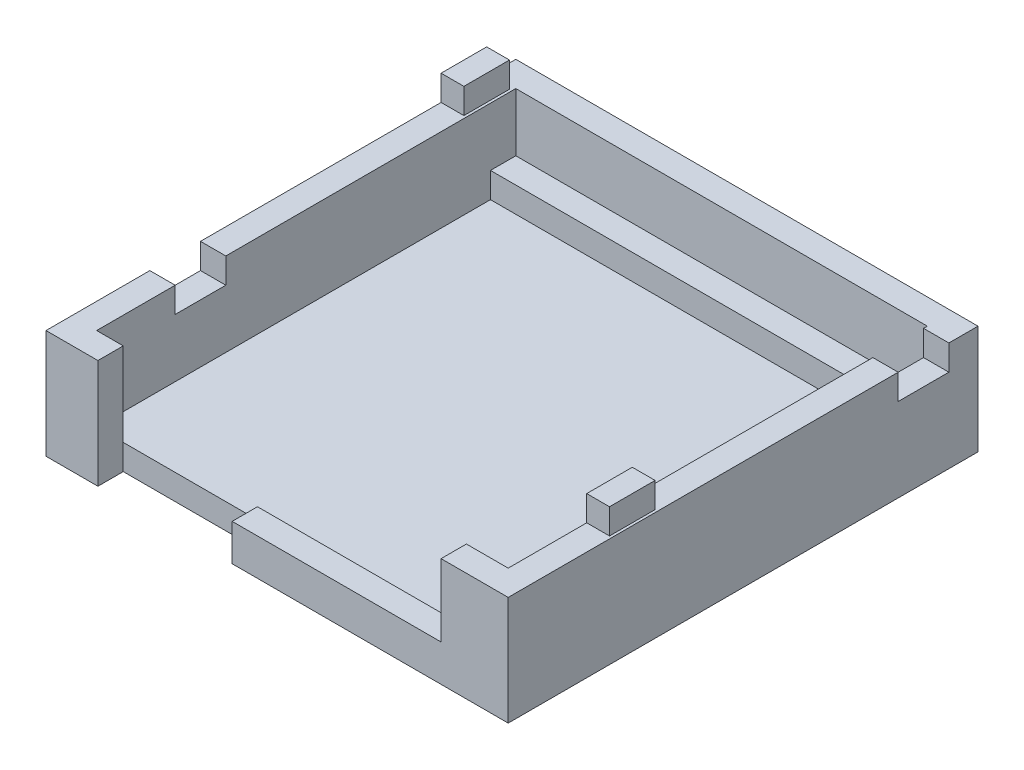
ISO-10303-21;
HEADER;
FILE_DESCRIPTION(('STEP AP214'),'2;1');
FILE_NAME('part.step','',(''),(''),'','','');
FILE_SCHEMA(('AUTOMOTIVE_DESIGN { 1 0 10303 214 1 1 1 1 }'));
ENDSEC;
DATA;
#1=APPLICATION_CONTEXT('core data for automotive mechanical design processes');
#2=APPLICATION_PROTOCOL_DEFINITION('international standard','automotive_design',2000,#1);
#3=PRODUCT_CONTEXT('',#1,'mechanical');
#4=PRODUCT('Part','Part','',(#3));
#5=PRODUCT_RELATED_PRODUCT_CATEGORY('part','',(#4));
#6=PRODUCT_DEFINITION_FORMATION('','',#4);
#7=PRODUCT_DEFINITION_CONTEXT('part definition',#1,'design');
#8=PRODUCT_DEFINITION('design','',#6,#7);
#9=PRODUCT_DEFINITION_SHAPE('','',#8);
#10=(LENGTH_UNIT() NAMED_UNIT(*) SI_UNIT(.MILLI.,.METRE.));
#11=(NAMED_UNIT(*) PLANE_ANGLE_UNIT() SI_UNIT($,.RADIAN.));
#12=(NAMED_UNIT(*) SI_UNIT($,.STERADIAN.) SOLID_ANGLE_UNIT());
#13=UNCERTAINTY_MEASURE_WITH_UNIT(LENGTH_MEASURE(1.E-05),#10,'distance_accuracy_value','');
#14=(GEOMETRIC_REPRESENTATION_CONTEXT(3) GLOBAL_UNCERTAINTY_ASSIGNED_CONTEXT((#13)) GLOBAL_UNIT_ASSIGNED_CONTEXT((#10,
#11,#12)) REPRESENTATION_CONTEXT('',''));
#15=CARTESIAN_POINT('',(0.,0.,0.));
#16=DIRECTION('',(0.,0.,1.));
#17=DIRECTION('',(1.,0.,0.));
#18=AXIS2_PLACEMENT_3D('',#15,#16,#17);
#19=CARTESIAN_POINT('',(0.,8.6,0.));
#20=DIRECTION('',(0.,1.,0.));
#21=DIRECTION('',(0.,0.,1.));
#22=AXIS2_PLACEMENT_3D('',#19,#20,#21);
#23=PLANE('',#22);
#24=DIRECTION('',(-1.,0.,0.));
#25=VECTOR('',#24,1.);
#26=CARTESIAN_POINT('',(34.5,8.6,2.3));
#27=LINE('',#26,#25);
#28=CARTESIAN_POINT('',(36.5,8.6,2.3));
#29=VERTEX_POINT('',#28);
#30=CARTESIAN_POINT('',(34.5,8.6,2.3));
#31=VERTEX_POINT('',#30);
#32=EDGE_CURVE('E275',#29,#31,#27,.T.);
#33=ORIENTED_EDGE('',*,*,#32,.F.);
#34=DIRECTION('',(0.,0.,-1.));
#35=VECTOR('',#34,1.);
#36=CARTESIAN_POINT('',(36.5,8.6,0.));
#37=LINE('',#36,#35);
#38=CARTESIAN_POINT('',(36.5,8.6,0.));
#39=VERTEX_POINT('',#38);
#40=EDGE_CURVE('E538',#29,#39,#37,.T.);
#41=ORIENTED_EDGE('',*,*,#40,.T.);
#42=DIRECTION('',(-1.,0.,0.));
#43=VECTOR('',#42,1.);
#44=CARTESIAN_POINT('',(0.,8.6,0.));
#45=LINE('',#44,#43);
#46=CARTESIAN_POINT('',(0.,8.6,0.));
#47=VERTEX_POINT('',#46);
#48=EDGE_CURVE('E543',#39,#47,#45,.T.);
#49=ORIENTED_EDGE('',*,*,#48,.T.);
#50=DIRECTION('',(0.,0.,1.));
#51=VECTOR('',#50,1.);
#52=CARTESIAN_POINT('',(0.,8.6,0.));
#53=LINE('',#52,#51);
#54=CARTESIAN_POINT('',(0.,8.6,2.3));
#55=VERTEX_POINT('',#54);
#56=EDGE_CURVE('E527',#47,#55,#53,.T.);
#57=ORIENTED_EDGE('',*,*,#56,.T.);
#58=DIRECTION('',(-1.,0.,0.));
#59=VECTOR('',#58,1.);
#60=CARTESIAN_POINT('',(0.,8.6,2.3));
#61=LINE('',#60,#59);
#62=CARTESIAN_POINT('',(1.8,8.6,2.3));
#63=VERTEX_POINT('',#62);
#64=EDGE_CURVE('E328',#63,#55,#61,.T.);
#65=ORIENTED_EDGE('',*,*,#64,.F.);
#66=DIRECTION('',(0.,0.,-1.));
#67=VECTOR('',#66,1.);
#68=CARTESIAN_POINT('',(1.8,8.6,2.3));
#69=LINE('',#68,#67);
#70=CARTESIAN_POINT('',(1.8,8.6,5.9));
#71=VERTEX_POINT('',#70);
#72=EDGE_CURVE('E341',#71,#63,#69,.T.);
#73=ORIENTED_EDGE('',*,*,#72,.F.);
#74=DIRECTION('',(1.,0.,0.));
#75=VECTOR('',#74,1.);
#76=CARTESIAN_POINT('',(0.,8.6,5.9));
#77=LINE('',#76,#75);
#78=CARTESIAN_POINT('',(0.,8.6,5.9));
#79=VERTEX_POINT('',#78);
#80=EDGE_CURVE('E338',#79,#71,#77,.T.);
#81=ORIENTED_EDGE('',*,*,#80,.F.);
#82=CARTESIAN_POINT('',(0.,8.6,24.9));
#83=VERTEX_POINT('',#82);
#84=EDGE_CURVE('E532',#79,#83,#53,.T.);
#85=ORIENTED_EDGE('',*,*,#84,.T.);
#86=DIRECTION('',(-1.,0.,0.));
#87=VECTOR('',#86,1.);
#88=CARTESIAN_POINT('',(0.,8.6,24.9));
#89=LINE('',#88,#87);
#90=CARTESIAN_POINT('',(2.,8.6,24.9));
#91=VERTEX_POINT('',#90);
#92=EDGE_CURVE('E293',#91,#83,#89,.T.);
#93=ORIENTED_EDGE('',*,*,#92,.F.);
#94=DIRECTION('',(0.,0.,1.));
#95=VECTOR('',#94,1.);
#96=CARTESIAN_POINT('',(2.,8.6,4.));
#97=LINE('',#96,#95);
#98=CARTESIAN_POINT('',(2.,8.6,2.));
#99=VERTEX_POINT('',#98);
#100=EDGE_CURVE('E492',#99,#91,#97,.T.);
#101=ORIENTED_EDGE('',*,*,#100,.F.);
#102=DIRECTION('',(-1.,0.,0.));
#103=VECTOR('',#102,1.);
#104=CARTESIAN_POINT('',(2.,8.6,2.));
#105=LINE('',#104,#103);
#106=CARTESIAN_POINT('',(34.5,8.6,2.));
#107=VERTEX_POINT('',#106);
#108=EDGE_CURVE('E454',#107,#99,#105,.T.);
#109=ORIENTED_EDGE('',*,*,#108,.F.);
#110=DIRECTION('',(0.,0.,-1.));
#111=VECTOR('',#110,1.);
#112=CARTESIAN_POINT('',(34.5,8.6,4.));
#113=LINE('',#112,#111);
#114=EDGE_CURVE('E501',#31,#107,#113,.T.);
#115=ORIENTED_EDGE('',*,*,#114,.F.);
#116=EDGE_LOOP('',(#33,#41,#49,#57,#65,#73,#81,#85,#93,#101,#109,#115));
#117=FACE_BOUND('',#116,.T.);
#118=ADVANCED_FACE('F42',(#117),#23,.T.);
#119=DIRECTION('',(1.,0.,0.));
#120=VECTOR('',#119,1.);
#121=CARTESIAN_POINT('',(34.5,8.6,6.3));
#122=LINE('',#121,#120);
#123=CARTESIAN_POINT('',(34.5,8.6,6.3));
#124=VERTEX_POINT('',#123);
#125=CARTESIAN_POINT('',(36.5,8.6,6.3));
#126=VERTEX_POINT('',#125);
#127=EDGE_CURVE('E313',#124,#126,#122,.T.);
#128=ORIENTED_EDGE('',*,*,#127,.F.);
#129=CARTESIAN_POINT('',(34.5,8.6,25.3));
#130=VERTEX_POINT('',#129);
#131=EDGE_CURVE('E280',#130,#124,#113,.T.);
#132=ORIENTED_EDGE('',*,*,#131,.F.);
#133=DIRECTION('',(-1.,0.,0.));
#134=VECTOR('',#133,1.);
#135=CARTESIAN_POINT('',(34.5,8.6,25.3));
#136=LINE('',#135,#134);
#137=CARTESIAN_POINT('',(36.3,8.6,25.3));
#138=VERTEX_POINT('',#137);
#139=EDGE_CURVE('E367',#138,#130,#136,.T.);
#140=ORIENTED_EDGE('',*,*,#139,.F.);
#141=DIRECTION('',(0.,0.,-1.));
#142=VECTOR('',#141,1.);
#143=CARTESIAN_POINT('',(36.3,8.6,25.3));
#144=LINE('',#143,#142);
#145=CARTESIAN_POINT('',(36.3,8.6,28.9));
#146=VERTEX_POINT('',#145);
#147=EDGE_CURVE('E380',#146,#138,#144,.T.);
#148=ORIENTED_EDGE('',*,*,#147,.F.);
#149=DIRECTION('',(1.,0.,0.));
#150=VECTOR('',#149,1.);
#151=CARTESIAN_POINT('',(34.5,8.6,28.9));
#152=LINE('',#151,#150);
#153=CARTESIAN_POINT('',(34.5,8.6,28.9));
#154=VERTEX_POINT('',#153);
#155=EDGE_CURVE('E361',#154,#146,#152,.T.);
#156=ORIENTED_EDGE('',*,*,#155,.F.);
#157=CARTESIAN_POINT('',(34.5,8.6,35.1));
#158=VERTEX_POINT('',#157);
#159=EDGE_CURVE('E502',#158,#154,#113,.T.);
#160=ORIENTED_EDGE('',*,*,#159,.F.);
#161=DIRECTION('',(1.,0.,0.));
#162=VECTOR('',#161,1.);
#163=CARTESIAN_POINT('',(2.,8.6,35.1));
#164=LINE('',#163,#162);
#165=CARTESIAN_POINT('',(31.2,8.6,35.1));
#166=VERTEX_POINT('',#165);
#167=EDGE_CURVE('E496',#166,#158,#164,.T.);
#168=ORIENTED_EDGE('',*,*,#167,.F.);
#169=DIRECTION('',(0.,0.,1.));
#170=VECTOR('',#169,1.);
#171=CARTESIAN_POINT('',(31.2,8.6,6.66815166050578));
#172=LINE('',#171,#170);
#173=CARTESIAN_POINT('',(31.2,8.6,37.1));
#174=VERTEX_POINT('',#173);
#175=EDGE_CURVE('E407',#166,#174,#172,.T.);
#176=ORIENTED_EDGE('',*,*,#175,.T.);
#177=DIRECTION('',(1.,0.,0.));
#178=VECTOR('',#177,1.);
#179=CARTESIAN_POINT('',(0.,8.6,37.1));
#180=LINE('',#179,#178);
#181=CARTESIAN_POINT('',(36.5,8.6,37.1));
#182=VERTEX_POINT('',#181);
#183=EDGE_CURVE('E531',#174,#182,#180,.T.);
#184=ORIENTED_EDGE('',*,*,#183,.T.);
#185=EDGE_CURVE('E539',#182,#126,#37,.T.);
#186=ORIENTED_EDGE('',*,*,#185,.T.);
#187=EDGE_LOOP('',(#128,#132,#140,#148,#156,#160,#168,#176,#184,#186));
#188=FACE_BOUND('',#187,.T.);
#189=ADVANCED_FACE('F654',(#188),#23,.T.);
#190=DIRECTION('',(1.,0.,0.));
#191=VECTOR('',#190,1.);
#192=CARTESIAN_POINT('',(0.,8.6,28.9));
#193=LINE('',#192,#191);
#194=CARTESIAN_POINT('',(0.,8.6,28.9));
#195=VERTEX_POINT('',#194);
#196=CARTESIAN_POINT('',(2.,8.6,28.9));
#197=VERTEX_POINT('',#196);
#198=EDGE_CURVE('E304',#195,#197,#193,.T.);
#199=ORIENTED_EDGE('',*,*,#198,.F.);
#200=CARTESIAN_POINT('',(0.,8.6,37.1));
#201=VERTEX_POINT('',#200);
#202=EDGE_CURVE('E533',#195,#201,#53,.T.);
#203=ORIENTED_EDGE('',*,*,#202,.T.);
#204=CARTESIAN_POINT('',(4.1,8.6,37.1));
#205=VERTEX_POINT('',#204);
#206=EDGE_CURVE('E534',#201,#205,#180,.T.);
#207=ORIENTED_EDGE('',*,*,#206,.T.);
#208=DIRECTION('',(0.,0.,1.));
#209=VECTOR('',#208,1.);
#210=CARTESIAN_POINT('',(4.1,8.6,6.66815166050578));
#211=LINE('',#210,#209);
#212=CARTESIAN_POINT('',(4.1,8.6,35.1));
#213=VERTEX_POINT('',#212);
#214=EDGE_CURVE('E431',#213,#205,#211,.T.);
#215=ORIENTED_EDGE('',*,*,#214,.F.);
#216=CARTESIAN_POINT('',(2.,8.6,35.1));
#217=VERTEX_POINT('',#216);
#218=EDGE_CURVE('E497',#217,#213,#164,.T.);
#219=ORIENTED_EDGE('',*,*,#218,.F.);
#220=EDGE_CURVE('E480',#197,#217,#97,.T.);
#221=ORIENTED_EDGE('',*,*,#220,.F.);
#222=EDGE_LOOP('',(#199,#203,#207,#215,#219,#221));
#223=FACE_BOUND('',#222,.T.);
#224=ADVANCED_FACE('F681',(#223),#23,.T.);
#225=CARTESIAN_POINT('',(0.,8.6,37.1));
#226=DIRECTION('',(0.,0.,-1.));
#227=DIRECTION('',(-1.,0.,0.));
#228=AXIS2_PLACEMENT_3D('',#225,#226,#227);
#229=PLANE('',#228);
#230=ORIENTED_EDGE('',*,*,#183,.F.);
#231=DIRECTION('',(0.,1.,0.));
#232=VECTOR('',#231,1.);
#233=CARTESIAN_POINT('',(31.2,2.9,37.1));
#234=LINE('',#233,#232);
#235=CARTESIAN_POINT('',(31.2,2.9,37.1));
#236=VERTEX_POINT('',#235);
#237=EDGE_CURVE('E428',#236,#174,#234,.T.);
#238=ORIENTED_EDGE('',*,*,#237,.F.);
#239=DIRECTION('',(1.,0.,0.));
#240=VECTOR('',#239,1.);
#241=CARTESIAN_POINT('',(14.7,2.89999999999999,37.1));
#242=LINE('',#241,#240);
#243=CARTESIAN_POINT('',(14.7,2.89999999999999,37.1));
#244=VERTEX_POINT('',#243);
#245=EDGE_CURVE('E424',#244,#236,#242,.T.);
#246=ORIENTED_EDGE('',*,*,#245,.F.);
#247=DIRECTION('',(0.,1.,0.));
#248=VECTOR('',#247,1.);
#249=CARTESIAN_POINT('',(14.7,0.,37.1));
#250=LINE('',#249,#248);
#251=CARTESIAN_POINT('',(14.7,0.,37.1));
#252=VERTEX_POINT('',#251);
#253=EDGE_CURVE('E420',#252,#244,#250,.T.);
#254=ORIENTED_EDGE('',*,*,#253,.F.);
#255=DIRECTION('',(1.,0.,0.));
#256=VECTOR('',#255,1.);
#257=CARTESIAN_POINT('',(0.,0.,37.1));
#258=LINE('',#257,#256);
#259=CARTESIAN_POINT('',(36.5,0.,37.1));
#260=VERTEX_POINT('',#259);
#261=EDGE_CURVE('E550',#252,#260,#258,.T.);
#262=ORIENTED_EDGE('',*,*,#261,.T.);
#263=DIRECTION('',(0.,-1.,0.));
#264=VECTOR('',#263,1.);
#265=CARTESIAN_POINT('',(36.5,8.6,37.1));
#266=LINE('',#265,#264);
#267=EDGE_CURVE('E51',#182,#260,#266,.T.);
#268=ORIENTED_EDGE('',*,*,#267,.F.);
#269=EDGE_LOOP('',(#230,#238,#246,#254,#262,#268));
#270=FACE_BOUND('',#269,.T.);
#271=ADVANCED_FACE('F688',(#270),#229,.F.);
#272=CARTESIAN_POINT('',(2.,-44.9828856344277,35.1));
#273=DIRECTION('',(0.,0.,1.));
#274=DIRECTION('',(1.,0.,0.));
#275=AXIS2_PLACEMENT_3D('',#272,#273,#274);
#276=PLANE('',#275);
#277=DIRECTION('',(-1.,0.,0.));
#278=VECTOR('',#277,1.);
#279=CARTESIAN_POINT('',(14.7,2.89999999999999,35.1));
#280=LINE('',#279,#278);
#281=CARTESIAN_POINT('',(31.2,2.9,35.1));
#282=VERTEX_POINT('',#281);
#283=CARTESIAN_POINT('',(14.7,2.89999999999999,35.1));
#284=VERTEX_POINT('',#283);
#285=EDGE_CURVE('E411',#282,#284,#280,.T.);
#286=ORIENTED_EDGE('',*,*,#285,.F.);
#287=DIRECTION('',(0.,-1.,0.));
#288=VECTOR('',#287,1.);
#289=CARTESIAN_POINT('',(31.2,2.9,35.1));
#290=LINE('',#289,#288);
#291=EDGE_CURVE('E414',#166,#282,#290,.T.);
#292=ORIENTED_EDGE('',*,*,#291,.F.);
#293=ORIENTED_EDGE('',*,*,#167,.T.);
#294=DIRECTION('',(0.,1.,0.));
#295=VECTOR('',#294,1.);
#296=CARTESIAN_POINT('',(34.5,-44.9828856344277,35.1));
#297=LINE('',#296,#295);
#298=CARTESIAN_POINT('',(34.5,2.,35.1));
#299=VERTEX_POINT('',#298);
#300=EDGE_CURVE('E514',#299,#158,#297,.T.);
#301=ORIENTED_EDGE('',*,*,#300,.F.);
#302=DIRECTION('',(-1.,0.,0.));
#303=VECTOR('',#302,1.);
#304=CARTESIAN_POINT('',(2.,2.,35.1));
#305=LINE('',#304,#303);
#306=CARTESIAN_POINT('',(14.7,2.,35.1));
#307=VERTEX_POINT('',#306);
#308=EDGE_CURVE('E521',#299,#307,#305,.T.);
#309=ORIENTED_EDGE('',*,*,#308,.T.);
#310=DIRECTION('',(0.,-1.,0.));
#311=VECTOR('',#310,1.);
#312=CARTESIAN_POINT('',(14.7,0.,35.1));
#313=LINE('',#312,#311);
#314=EDGE_CURVE('E408',#284,#307,#313,.T.);
#315=ORIENTED_EDGE('',*,*,#314,.F.);
#316=EDGE_LOOP('',(#286,#292,#293,#301,#309,#315));
#317=FACE_BOUND('',#316,.T.);
#318=ADVANCED_FACE('F649',(#317),#276,.F.);
#319=CARTESIAN_POINT('',(2.,-44.9828856344277,4.));
#320=DIRECTION('',(0.,0.,-1.));
#321=DIRECTION('',(-1.,0.,0.));
#322=AXIS2_PLACEMENT_3D('',#319,#320,#321);
#323=PLANE('',#322);
#324=DIRECTION('',(-1.,0.,0.));
#325=VECTOR('',#324,1.);
#326=CARTESIAN_POINT('',(2.,4.,4.));
#327=LINE('',#326,#325);
#328=CARTESIAN_POINT('',(34.5,4.,4.));
#329=VERTEX_POINT('',#328);
#330=CARTESIAN_POINT('',(2.,4.,4.));
#331=VERTEX_POINT('',#330);
#332=EDGE_CURVE('E466',#329,#331,#327,.T.);
#333=ORIENTED_EDGE('',*,*,#332,.T.);
#334=DIRECTION('',(0.,1.,0.));
#335=VECTOR('',#334,1.);
#336=CARTESIAN_POINT('',(2.,-44.9828856344277,4.));
#337=LINE('',#336,#335);
#338=CARTESIAN_POINT('',(2.,2.,4.));
#339=VERTEX_POINT('',#338);
#340=EDGE_CURVE('E485',#339,#331,#337,.T.);
#341=ORIENTED_EDGE('',*,*,#340,.F.);
#342=DIRECTION('',(1.,0.,0.));
#343=VECTOR('',#342,1.);
#344=CARTESIAN_POINT('',(2.,2.,4.));
#345=LINE('',#344,#343);
#346=CARTESIAN_POINT('',(34.5,2.,4.));
#347=VERTEX_POINT('',#346);
#348=EDGE_CURVE('E484',#339,#347,#345,.T.);
#349=ORIENTED_EDGE('',*,*,#348,.T.);
#350=DIRECTION('',(0.,1.,0.));
#351=VECTOR('',#350,1.);
#352=CARTESIAN_POINT('',(34.5,-44.9828856344277,4.));
#353=LINE('',#352,#351);
#354=EDGE_CURVE('E510',#347,#329,#353,.T.);
#355=ORIENTED_EDGE('',*,*,#354,.T.);
#356=EDGE_LOOP('',(#333,#341,#349,#355));
#357=FACE_BOUND('',#356,.T.);
#358=ADVANCED_FACE('F636',(#357),#323,.F.);
#359=CARTESIAN_POINT('',(0.,8.6,0.));
#360=DIRECTION('',(1.,0.,0.));
#361=DIRECTION('',(0.,0.,-1.));
#362=AXIS2_PLACEMENT_3D('',#359,#360,#361);
#363=PLANE('',#362);
#364=DIRECTION('',(0.,0.,1.));
#365=VECTOR('',#364,1.);
#366=CARTESIAN_POINT('',(0.,6.6,24.9));
#367=LINE('',#366,#365);
#368=CARTESIAN_POINT('',(0.,6.6,24.9));
#369=VERTEX_POINT('',#368);
#370=CARTESIAN_POINT('',(0.,6.6,28.9));
#371=VERTEX_POINT('',#370);
#372=EDGE_CURVE('E290',#369,#371,#367,.T.);
#373=ORIENTED_EDGE('',*,*,#372,.F.);
#374=DIRECTION('',(0.,1.,0.));
#375=VECTOR('',#374,1.);
#376=CARTESIAN_POINT('',(0.,6.6,24.9));
#377=LINE('',#376,#375);
#378=EDGE_CURVE('E309',#369,#83,#377,.T.);
#379=ORIENTED_EDGE('',*,*,#378,.T.);
#380=ORIENTED_EDGE('',*,*,#84,.F.);
#381=DIRECTION('',(0.,-1.,0.));
#382=VECTOR('',#381,1.);
#383=CARTESIAN_POINT('',(0.,10.6,5.9));
#384=LINE('',#383,#382);
#385=CARTESIAN_POINT('',(0.,10.6,5.9));
#386=VERTEX_POINT('',#385);
#387=EDGE_CURVE('E358',#386,#79,#384,.T.);
#388=ORIENTED_EDGE('',*,*,#387,.F.);
#389=DIRECTION('',(0.,0.,1.));
#390=VECTOR('',#389,1.);
#391=CARTESIAN_POINT('',(0.,10.6,2.3));
#392=LINE('',#391,#390);
#393=CARTESIAN_POINT('',(0.,10.6,2.3));
#394=VERTEX_POINT('',#393);
#395=EDGE_CURVE('E323',#394,#386,#392,.T.);
#396=ORIENTED_EDGE('',*,*,#395,.F.);
#397=DIRECTION('',(0.,-1.,0.));
#398=VECTOR('',#397,1.);
#399=CARTESIAN_POINT('',(0.,10.6,2.3));
#400=LINE('',#399,#398);
#401=EDGE_CURVE('E337',#394,#55,#400,.T.);
#402=ORIENTED_EDGE('',*,*,#401,.T.);
#403=ORIENTED_EDGE('',*,*,#56,.F.);
#404=DIRECTION('',(0.,-1.,0.));
#405=VECTOR('',#404,1.);
#406=CARTESIAN_POINT('',(0.,8.6,0.));
#407=LINE('',#406,#405);
#408=CARTESIAN_POINT('',(0.,0.,0.));
#409=VERTEX_POINT('',#408);
#410=EDGE_CURVE('E546',#47,#409,#407,.T.);
#411=ORIENTED_EDGE('',*,*,#410,.T.);
#412=DIRECTION('',(0.,0.,1.));
#413=VECTOR('',#412,1.);
#414=CARTESIAN_POINT('',(0.,0.,0.));
#415=LINE('',#414,#413);
#416=CARTESIAN_POINT('',(0.,0.,37.1));
#417=VERTEX_POINT('',#416);
#418=EDGE_CURVE('E525',#409,#417,#415,.T.);
#419=ORIENTED_EDGE('',*,*,#418,.T.);
#420=DIRECTION('',(0.,-1.,0.));
#421=VECTOR('',#420,1.);
#422=CARTESIAN_POINT('',(0.,8.6,37.1));
#423=LINE('',#422,#421);
#424=EDGE_CURVE('E13',#201,#417,#423,.T.);
#425=ORIENTED_EDGE('',*,*,#424,.F.);
#426=ORIENTED_EDGE('',*,*,#202,.F.);
#427=DIRECTION('',(0.,1.,0.));
#428=VECTOR('',#427,1.);
#429=CARTESIAN_POINT('',(0.,6.6,28.9));
#430=LINE('',#429,#428);
#431=EDGE_CURVE('E303',#371,#195,#430,.T.);
#432=ORIENTED_EDGE('',*,*,#431,.F.);
#433=EDGE_LOOP('',(#373,#379,#380,#388,#396,#402,#403,#411,#419,#425,#426,#432));
#434=FACE_BOUND('',#433,.T.);
#435=ADVANCED_FACE('F44',(#434),#363,.F.);
#436=CARTESIAN_POINT('',(4.1,0.,37.1));
#437=VERTEX_POINT('',#436);
#438=EDGE_CURVE('E551',#417,#437,#258,.T.);
#439=ORIENTED_EDGE('',*,*,#438,.T.);
#440=DIRECTION('',(0.,-1.,0.));
#441=VECTOR('',#440,1.);
#442=CARTESIAN_POINT('',(4.1,0.,37.1));
#443=LINE('',#442,#441);
#444=EDGE_CURVE('E401',#205,#437,#443,.T.);
#445=ORIENTED_EDGE('',*,*,#444,.F.);
#446=ORIENTED_EDGE('',*,*,#206,.F.);
#447=ORIENTED_EDGE('',*,*,#424,.T.);
#448=EDGE_LOOP('',(#439,#445,#446,#447));
#449=FACE_BOUND('',#448,.T.);
#450=ADVANCED_FACE('F693',(#449),#229,.F.);
#451=CARTESIAN_POINT('',(36.5,8.6,0.));
#452=DIRECTION('',(-1.,0.,0.));
#453=DIRECTION('',(0.,0.,1.));
#454=AXIS2_PLACEMENT_3D('',#451,#452,#453);
#455=PLANE('',#454);
#456=ORIENTED_EDGE('',*,*,#40,.F.);
#457=DIRECTION('',(0.,1.,0.));
#458=VECTOR('',#457,1.);
#459=CARTESIAN_POINT('',(36.5,6.6,2.3));
#460=LINE('',#459,#458);
#461=CARTESIAN_POINT('',(36.5,6.6,2.3));
#462=VERTEX_POINT('',#461);
#463=EDGE_CURVE('E285',#462,#29,#460,.T.);
#464=ORIENTED_EDGE('',*,*,#463,.F.);
#465=DIRECTION('',(0.,0.,-1.));
#466=VECTOR('',#465,1.);
#467=CARTESIAN_POINT('',(36.5,6.6,2.3));
#468=LINE('',#467,#466);
#469=CARTESIAN_POINT('',(36.5,6.6,6.3));
#470=VERTEX_POINT('',#469);
#471=EDGE_CURVE('E267',#470,#462,#468,.T.);
#472=ORIENTED_EDGE('',*,*,#471,.F.);
#473=DIRECTION('',(0.,1.,0.));
#474=VECTOR('',#473,1.);
#475=CARTESIAN_POINT('',(36.5,6.6,6.3));
#476=LINE('',#475,#474);
#477=EDGE_CURVE('E264',#470,#126,#476,.T.);
#478=ORIENTED_EDGE('',*,*,#477,.T.);
#479=ORIENTED_EDGE('',*,*,#185,.F.);
#480=ORIENTED_EDGE('',*,*,#267,.T.);
#481=DIRECTION('',(0.,0.,-1.));
#482=VECTOR('',#481,1.);
#483=CARTESIAN_POINT('',(36.5,0.,0.));
#484=LINE('',#483,#482);
#485=CARTESIAN_POINT('',(36.5,0.,0.));
#486=VERTEX_POINT('',#485);
#487=EDGE_CURVE('E555',#260,#486,#484,.T.);
#488=ORIENTED_EDGE('',*,*,#487,.T.);
#489=DIRECTION('',(0.,-1.,0.));
#490=VECTOR('',#489,1.);
#491=CARTESIAN_POINT('',(36.5,8.6,0.));
#492=LINE('',#491,#490);
#493=EDGE_CURVE('E564',#39,#486,#492,.T.);
#494=ORIENTED_EDGE('',*,*,#493,.F.);
#495=EDGE_LOOP('',(#456,#464,#472,#478,#479,#480,#488,#494));
#496=FACE_BOUND('',#495,.T.);
#497=ADVANCED_FACE('F574',(#496),#455,.F.);
#498=CARTESIAN_POINT('',(0.,8.6,0.));
#499=DIRECTION('',(0.,0.,1.));
#500=DIRECTION('',(1.,0.,0.));
#501=AXIS2_PLACEMENT_3D('',#498,#499,#500);
#502=PLANE('',#501);
#503=DIRECTION('',(-1.,0.,0.));
#504=VECTOR('',#503,1.);
#505=CARTESIAN_POINT('',(0.,0.,0.));
#506=LINE('',#505,#504);
#507=EDGE_CURVE('E558',#486,#409,#506,.T.);
#508=ORIENTED_EDGE('',*,*,#507,.T.);
#509=ORIENTED_EDGE('',*,*,#410,.F.);
#510=ORIENTED_EDGE('',*,*,#48,.F.);
#511=ORIENTED_EDGE('',*,*,#493,.T.);
#512=EDGE_LOOP('',(#508,#509,#510,#511));
#513=FACE_BOUND('',#512,.T.);
#514=ADVANCED_FACE('F586',(#513),#502,.F.);
#515=CARTESIAN_POINT('',(0.,0.,0.));
#516=DIRECTION('',(0.,1.,0.));
#517=DIRECTION('',(0.,0.,1.));
#518=AXIS2_PLACEMENT_3D('',#515,#516,#517);
#519=PLANE('',#518);
#520=ORIENTED_EDGE('',*,*,#261,.F.);
#521=DIRECTION('',(0.,0.,1.));
#522=VECTOR('',#521,1.);
#523=CARTESIAN_POINT('',(14.7,0.,6.66815166050578));
#524=LINE('',#523,#522);
#525=CARTESIAN_POINT('',(14.7,0.,35.1));
#526=VERTEX_POINT('',#525);
#527=EDGE_CURVE('E441',#526,#252,#524,.T.);
#528=ORIENTED_EDGE('',*,*,#527,.F.);
#529=DIRECTION('',(-1.,0.,0.));
#530=VECTOR('',#529,1.);
#531=CARTESIAN_POINT('',(14.7,0.,35.1));
#532=LINE('',#531,#530);
#533=CARTESIAN_POINT('',(4.1,0.,35.1));
#534=VERTEX_POINT('',#533);
#535=EDGE_CURVE('E402',#526,#534,#532,.T.);
#536=ORIENTED_EDGE('',*,*,#535,.T.);
#537=DIRECTION('',(0.,0.,1.));
#538=VECTOR('',#537,1.);
#539=CARTESIAN_POINT('',(4.1,0.,6.66815166050578));
#540=LINE('',#539,#538);
#541=EDGE_CURVE('E444',#534,#437,#540,.T.);
#542=ORIENTED_EDGE('',*,*,#541,.T.);
#543=ORIENTED_EDGE('',*,*,#438,.F.);
#544=ORIENTED_EDGE('',*,*,#418,.F.);
#545=ORIENTED_EDGE('',*,*,#507,.F.);
#546=ORIENTED_EDGE('',*,*,#487,.F.);
#547=EDGE_LOOP('',(#520,#528,#536,#542,#543,#544,#545,#546));
#548=FACE_BOUND('',#547,.T.);
#549=ADVANCED_FACE('F581',(#548),#519,.F.);
#550=CARTESIAN_POINT('',(2.,-44.9828856344277,4.));
#551=DIRECTION('',(-1.,0.,0.));
#552=DIRECTION('',(0.,0.,1.));
#553=AXIS2_PLACEMENT_3D('',#550,#551,#552);
#554=PLANE('',#553);
#555=ORIENTED_EDGE('',*,*,#100,.T.);
#556=DIRECTION('',(0.,1.,0.));
#557=VECTOR('',#556,1.);
#558=CARTESIAN_POINT('',(2.,6.6,24.9));
#559=LINE('',#558,#557);
#560=CARTESIAN_POINT('',(2.,6.6,24.9));
#561=VERTEX_POINT('',#560);
#562=EDGE_CURVE('E314',#561,#91,#559,.T.);
#563=ORIENTED_EDGE('',*,*,#562,.F.);
#564=DIRECTION('',(0.,0.,-1.));
#565=VECTOR('',#564,1.);
#566=CARTESIAN_POINT('',(2.,6.6,24.9));
#567=LINE('',#566,#565);
#568=CARTESIAN_POINT('',(2.,6.6,28.9));
#569=VERTEX_POINT('',#568);
#570=EDGE_CURVE('E296',#569,#561,#567,.T.);
#571=ORIENTED_EDGE('',*,*,#570,.F.);
#572=DIRECTION('',(0.,1.,0.));
#573=VECTOR('',#572,1.);
#574=CARTESIAN_POINT('',(2.,6.6,28.9));
#575=LINE('',#574,#573);
#576=EDGE_CURVE('E317',#569,#197,#575,.T.);
#577=ORIENTED_EDGE('',*,*,#576,.T.);
#578=ORIENTED_EDGE('',*,*,#220,.T.);
#579=DIRECTION('',(0.,1.,0.));
#580=VECTOR('',#579,1.);
#581=CARTESIAN_POINT('',(2.,-44.9828856344277,35.1));
#582=LINE('',#581,#580);
#583=CARTESIAN_POINT('',(2.,2.,35.1));
#584=VERTEX_POINT('',#583);
#585=EDGE_CURVE('E506',#584,#217,#582,.T.);
#586=ORIENTED_EDGE('',*,*,#585,.F.);
#587=DIRECTION('',(0.,0.,-1.));
#588=VECTOR('',#587,1.);
#589=CARTESIAN_POINT('',(2.,2.,4.));
#590=LINE('',#589,#588);
#591=EDGE_CURVE('E488',#584,#339,#590,.T.);
#592=ORIENTED_EDGE('',*,*,#591,.T.);
#593=ORIENTED_EDGE('',*,*,#340,.T.);
#594=DIRECTION('',(0.,0.,-1.));
#595=VECTOR('',#594,1.);
#596=CARTESIAN_POINT('',(2.,4.,4.));
#597=LINE('',#596,#595);
#598=CARTESIAN_POINT('',(2.,4.,2.));
#599=VERTEX_POINT('',#598);
#600=EDGE_CURVE('E463',#331,#599,#597,.T.);
#601=ORIENTED_EDGE('',*,*,#600,.T.);
#602=DIRECTION('',(0.,1.,0.));
#603=VECTOR('',#602,1.);
#604=CARTESIAN_POINT('',(2.,-30.5614803103299,2.));
#605=LINE('',#604,#603);
#606=EDGE_CURVE('E460',#599,#99,#605,.T.);
#607=ORIENTED_EDGE('',*,*,#606,.T.);
#608=EDGE_LOOP('',(#555,#563,#571,#577,#578,#586,#592,#593,#601,#607));
#609=FACE_BOUND('',#608,.T.);
#610=ADVANCED_FACE('F711',(#609),#554,.F.);
#611=CARTESIAN_POINT('',(34.5,-44.9828856344277,4.));
#612=DIRECTION('',(1.,0.,0.));
#613=DIRECTION('',(0.,0.,-1.));
#614=AXIS2_PLACEMENT_3D('',#611,#612,#613);
#615=PLANE('',#614);
#616=DIRECTION('',(0.,0.,1.));
#617=VECTOR('',#616,1.);
#618=CARTESIAN_POINT('',(34.5,6.6,2.3));
#619=LINE('',#618,#617);
#620=CARTESIAN_POINT('',(34.5,6.6,2.3));
#621=VERTEX_POINT('',#620);
#622=CARTESIAN_POINT('',(34.5,6.6,6.3));
#623=VERTEX_POINT('',#622);
#624=EDGE_CURVE('E268',#621,#623,#619,.T.);
#625=ORIENTED_EDGE('',*,*,#624,.F.);
#626=DIRECTION('',(0.,1.,0.));
#627=VECTOR('',#626,1.);
#628=CARTESIAN_POINT('',(34.5,6.6,2.3));
#629=LINE('',#628,#627);
#630=EDGE_CURVE('E342',#621,#31,#629,.T.);
#631=ORIENTED_EDGE('',*,*,#630,.T.);
#632=ORIENTED_EDGE('',*,*,#114,.T.);
#633=DIRECTION('',(0.,1.,0.));
#634=VECTOR('',#633,1.);
#635=CARTESIAN_POINT('',(34.5,-30.5614803103299,2.));
#636=LINE('',#635,#634);
#637=CARTESIAN_POINT('',(34.5,4.,2.));
#638=VERTEX_POINT('',#637);
#639=EDGE_CURVE('E470',#638,#107,#636,.T.);
#640=ORIENTED_EDGE('',*,*,#639,.F.);
#641=DIRECTION('',(0.,0.,1.));
#642=VECTOR('',#641,1.);
#643=CARTESIAN_POINT('',(34.5,4.,4.));
#644=LINE('',#643,#642);
#645=EDGE_CURVE('E455',#638,#329,#644,.T.);
#646=ORIENTED_EDGE('',*,*,#645,.T.);
#647=ORIENTED_EDGE('',*,*,#354,.F.);
#648=DIRECTION('',(0.,0.,1.));
#649=VECTOR('',#648,1.);
#650=CARTESIAN_POINT('',(34.5,2.,4.));
#651=LINE('',#650,#649);
#652=EDGE_CURVE('E481',#347,#299,#651,.T.);
#653=ORIENTED_EDGE('',*,*,#652,.T.);
#654=ORIENTED_EDGE('',*,*,#300,.T.);
#655=ORIENTED_EDGE('',*,*,#159,.T.);
#656=DIRECTION('',(0.,-1.,0.));
#657=VECTOR('',#656,1.);
#658=CARTESIAN_POINT('',(34.5,10.6,28.9));
#659=LINE('',#658,#657);
#660=CARTESIAN_POINT('',(34.5,10.6,28.9));
#661=VERTEX_POINT('',#660);
#662=EDGE_CURVE('E397',#661,#154,#659,.T.);
#663=ORIENTED_EDGE('',*,*,#662,.F.);
#664=DIRECTION('',(0.,0.,1.));
#665=VECTOR('',#664,1.);
#666=CARTESIAN_POINT('',(34.5,10.6,25.3));
#667=LINE('',#666,#665);
#668=CARTESIAN_POINT('',(34.5,10.6,25.3));
#669=VERTEX_POINT('',#668);
#670=EDGE_CURVE('E362',#669,#661,#667,.T.);
#671=ORIENTED_EDGE('',*,*,#670,.F.);
#672=DIRECTION('',(0.,-1.,0.));
#673=VECTOR('',#672,1.);
#674=CARTESIAN_POINT('',(34.5,10.6,25.3));
#675=LINE('',#674,#673);
#676=EDGE_CURVE('E376',#669,#130,#675,.T.);
#677=ORIENTED_EDGE('',*,*,#676,.T.);
#678=ORIENTED_EDGE('',*,*,#131,.T.);
#679=DIRECTION('',(0.,1.,0.));
#680=VECTOR('',#679,1.);
#681=CARTESIAN_POINT('',(34.5,6.6,6.3));
#682=LINE('',#681,#680);
#683=EDGE_CURVE('E261',#623,#124,#682,.T.);
#684=ORIENTED_EDGE('',*,*,#683,.F.);
#685=EDGE_LOOP('',(#625,#631,#632,#640,#646,#647,#653,#654,#655,#663,#671,#677,#678,#684));
#686=FACE_BOUND('',#685,.T.);
#687=ADVANCED_FACE('F278',(#686),#615,.F.);
#688=ORIENTED_EDGE('',*,*,#218,.T.);
#689=DIRECTION('',(0.,1.,0.));
#690=VECTOR('',#689,1.);
#691=CARTESIAN_POINT('',(4.1,0.,35.1));
#692=LINE('',#691,#690);
#693=CARTESIAN_POINT('',(4.1,2.,35.1));
#694=VERTEX_POINT('',#693);
#695=EDGE_CURVE('E417',#694,#213,#692,.T.);
#696=ORIENTED_EDGE('',*,*,#695,.F.);
#697=EDGE_CURVE('E491',#694,#584,#305,.T.);
#698=ORIENTED_EDGE('',*,*,#697,.T.);
#699=ORIENTED_EDGE('',*,*,#585,.T.);
#700=EDGE_LOOP('',(#688,#696,#698,#699));
#701=FACE_BOUND('',#700,.T.);
#702=ADVANCED_FACE('F707',(#701),#276,.F.);
#703=CARTESIAN_POINT('',(0.,2.,0.));
#704=DIRECTION('',(0.,1.,0.));
#705=DIRECTION('',(0.,0.,1.));
#706=AXIS2_PLACEMENT_3D('',#703,#704,#705);
#707=PLANE('',#706);
#708=ORIENTED_EDGE('',*,*,#591,.F.);
#709=ORIENTED_EDGE('',*,*,#697,.F.);
#710=EDGE_CURVE('E526',#307,#694,#305,.T.);
#711=ORIENTED_EDGE('',*,*,#710,.F.);
#712=ORIENTED_EDGE('',*,*,#308,.F.);
#713=ORIENTED_EDGE('',*,*,#652,.F.);
#714=ORIENTED_EDGE('',*,*,#348,.F.);
#715=EDGE_LOOP('',(#708,#709,#711,#712,#713,#714));
#716=FACE_BOUND('',#715,.T.);
#717=ADVANCED_FACE('F643',(#716),#707,.T.);
#718=CARTESIAN_POINT('',(2.,-30.5614803103299,2.));
#719=DIRECTION('',(0.,0.,-1.));
#720=DIRECTION('',(-1.,0.,0.));
#721=AXIS2_PLACEMENT_3D('',#718,#719,#720);
#722=PLANE('',#721);
#723=DIRECTION('',(1.,0.,0.));
#724=VECTOR('',#723,1.);
#725=CARTESIAN_POINT('',(2.,4.,2.));
#726=LINE('',#725,#724);
#727=EDGE_CURVE('E459',#599,#638,#726,.T.);
#728=ORIENTED_EDGE('',*,*,#727,.T.);
#729=ORIENTED_EDGE('',*,*,#639,.T.);
#730=ORIENTED_EDGE('',*,*,#108,.T.);
#731=ORIENTED_EDGE('',*,*,#606,.F.);
#732=EDGE_LOOP('',(#728,#729,#730,#731));
#733=FACE_BOUND('',#732,.T.);
#734=ADVANCED_FACE('F630',(#733),#722,.F.);
#735=CARTESIAN_POINT('',(0.,4.,0.));
#736=DIRECTION('',(0.,1.,0.));
#737=DIRECTION('',(0.,0.,1.));
#738=AXIS2_PLACEMENT_3D('',#735,#736,#737);
#739=PLANE('',#738);
#740=ORIENTED_EDGE('',*,*,#600,.F.);
#741=ORIENTED_EDGE('',*,*,#332,.F.);
#742=ORIENTED_EDGE('',*,*,#645,.F.);
#743=ORIENTED_EDGE('',*,*,#727,.F.);
#744=EDGE_LOOP('',(#740,#741,#742,#743));
#745=FACE_BOUND('',#744,.T.);
#746=ADVANCED_FACE('F877',(#745),#739,.T.);
#747=CARTESIAN_POINT('',(31.2,2.9,6.66815166050578));
#748=DIRECTION('',(1.,0.,0.));
#749=DIRECTION('',(0.,0.,-1.));
#750=AXIS2_PLACEMENT_3D('',#747,#748,#749);
#751=PLANE('',#750);
#752=ORIENTED_EDGE('',*,*,#291,.T.);
#753=DIRECTION('',(0.,0.,1.));
#754=VECTOR('',#753,1.);
#755=CARTESIAN_POINT('',(31.2,2.9,6.66815166050578));
#756=LINE('',#755,#754);
#757=EDGE_CURVE('E435',#282,#236,#756,.T.);
#758=ORIENTED_EDGE('',*,*,#757,.T.);
#759=ORIENTED_EDGE('',*,*,#237,.T.);
#760=ORIENTED_EDGE('',*,*,#175,.F.);
#761=EDGE_LOOP('',(#752,#758,#759,#760));
#762=FACE_BOUND('',#761,.T.);
#763=ADVANCED_FACE('F879',(#762),#751,.F.);
#764=CARTESIAN_POINT('',(14.7,2.89999999999999,6.66815166050578));
#765=DIRECTION('',(0.,-1.,0.));
#766=DIRECTION('',(1.,0.,0.));
#767=AXIS2_PLACEMENT_3D('',#764,#765,#766);
#768=PLANE('',#767);
#769=ORIENTED_EDGE('',*,*,#285,.T.);
#770=DIRECTION('',(0.,0.,1.));
#771=VECTOR('',#770,1.);
#772=CARTESIAN_POINT('',(14.7,2.89999999999999,6.66815166050578));
#773=LINE('',#772,#771);
#774=EDGE_CURVE('E438',#284,#244,#773,.T.);
#775=ORIENTED_EDGE('',*,*,#774,.T.);
#776=ORIENTED_EDGE('',*,*,#245,.T.);
#777=ORIENTED_EDGE('',*,*,#757,.F.);
#778=EDGE_LOOP('',(#769,#775,#776,#777));
#779=FACE_BOUND('',#778,.T.);
#780=ADVANCED_FACE('F885',(#779),#768,.F.);
#781=CARTESIAN_POINT('',(14.7,0.,6.66815166050578));
#782=DIRECTION('',(1.,0.,0.));
#783=DIRECTION('',(0.,0.,-1.));
#784=AXIS2_PLACEMENT_3D('',#781,#782,#783);
#785=PLANE('',#784);
#786=ORIENTED_EDGE('',*,*,#314,.T.);
#787=EDGE_CURVE('E406',#307,#526,#313,.T.);
#788=ORIENTED_EDGE('',*,*,#787,.T.);
#789=ORIENTED_EDGE('',*,*,#527,.T.);
#790=ORIENTED_EDGE('',*,*,#253,.T.);
#791=ORIENTED_EDGE('',*,*,#774,.F.);
#792=EDGE_LOOP('',(#786,#788,#789,#790,#791));
#793=FACE_BOUND('',#792,.T.);
#794=ADVANCED_FACE('F942',(#793),#785,.F.);
#795=CARTESIAN_POINT('',(4.1,0.,6.66815166050578));
#796=DIRECTION('',(-1.,0.,0.));
#797=DIRECTION('',(0.,0.,1.));
#798=AXIS2_PLACEMENT_3D('',#795,#796,#797);
#799=PLANE('',#798);
#800=EDGE_CURVE('E450',#534,#694,#692,.T.);
#801=ORIENTED_EDGE('',*,*,#800,.T.);
#802=ORIENTED_EDGE('',*,*,#695,.T.);
#803=ORIENTED_EDGE('',*,*,#214,.T.);
#804=ORIENTED_EDGE('',*,*,#444,.T.);
#805=ORIENTED_EDGE('',*,*,#541,.F.);
#806=EDGE_LOOP('',(#801,#802,#803,#804,#805));
#807=FACE_BOUND('',#806,.T.);
#808=ADVANCED_FACE('F890',(#807),#799,.F.);
#809=CARTESIAN_POINT('',(2.,-44.9828856344277,35.1));
#810=DIRECTION('',(0.,0.,1.));
#811=DIRECTION('',(1.,0.,0.));
#812=AXIS2_PLACEMENT_3D('',#809,#810,#811);
#813=PLANE('',#812);
#814=ORIENTED_EDGE('',*,*,#800,.F.);
#815=ORIENTED_EDGE('',*,*,#535,.F.);
#816=ORIENTED_EDGE('',*,*,#787,.F.);
#817=ORIENTED_EDGE('',*,*,#710,.T.);
#818=EDGE_LOOP('',(#814,#815,#816,#817));
#819=FACE_BOUND('',#818,.T.);
#820=ADVANCED_FACE('F677',(#819),#813,.T.);
#821=CARTESIAN_POINT('',(34.5,10.6,28.9));
#822=DIRECTION('',(0.,0.,-1.));
#823=DIRECTION('',(-1.,0.,0.));
#824=AXIS2_PLACEMENT_3D('',#821,#822,#823);
#825=PLANE('',#824);
#826=ORIENTED_EDGE('',*,*,#155,.T.);
#827=DIRECTION('',(0.,-1.,0.));
#828=VECTOR('',#827,1.);
#829=CARTESIAN_POINT('',(36.3,10.6,28.9));
#830=LINE('',#829,#828);
#831=CARTESIAN_POINT('',(36.3,10.6,28.9));
#832=VERTEX_POINT('',#831);
#833=EDGE_CURVE('E393',#832,#146,#830,.T.);
#834=ORIENTED_EDGE('',*,*,#833,.F.);
#835=DIRECTION('',(1.,0.,0.));
#836=VECTOR('',#835,1.);
#837=CARTESIAN_POINT('',(34.5,10.6,28.9));
#838=LINE('',#837,#836);
#839=EDGE_CURVE('E366',#661,#832,#838,.T.);
#840=ORIENTED_EDGE('',*,*,#839,.F.);
#841=ORIENTED_EDGE('',*,*,#662,.T.);
#842=EDGE_LOOP('',(#826,#834,#840,#841));
#843=FACE_BOUND('',#842,.T.);
#844=ADVANCED_FACE('F658',(#843),#825,.F.);
#845=CARTESIAN_POINT('',(36.3,10.6,25.3));
#846=DIRECTION('',(-1.,0.,0.));
#847=DIRECTION('',(0.,0.,1.));
#848=AXIS2_PLACEMENT_3D('',#845,#846,#847);
#849=PLANE('',#848);
#850=ORIENTED_EDGE('',*,*,#147,.T.);
#851=DIRECTION('',(0.,-1.,0.));
#852=VECTOR('',#851,1.);
#853=CARTESIAN_POINT('',(36.3,10.6,25.3));
#854=LINE('',#853,#852);
#855=CARTESIAN_POINT('',(36.3,10.6,25.3));
#856=VERTEX_POINT('',#855);
#857=EDGE_CURVE('E389',#856,#138,#854,.T.);
#858=ORIENTED_EDGE('',*,*,#857,.F.);
#859=DIRECTION('',(0.,0.,-1.));
#860=VECTOR('',#859,1.);
#861=CARTESIAN_POINT('',(36.3,10.6,25.3));
#862=LINE('',#861,#860);
#863=EDGE_CURVE('E370',#832,#856,#862,.T.);
#864=ORIENTED_EDGE('',*,*,#863,.F.);
#865=ORIENTED_EDGE('',*,*,#833,.T.);
#866=EDGE_LOOP('',(#850,#858,#864,#865));
#867=FACE_BOUND('',#866,.T.);
#868=ADVANCED_FACE('F669',(#867),#849,.F.);
#869=CARTESIAN_POINT('',(34.5,10.6,25.3));
#870=DIRECTION('',(0.,0.,1.));
#871=DIRECTION('',(1.,0.,0.));
#872=AXIS2_PLACEMENT_3D('',#869,#870,#871);
#873=PLANE('',#872);
#874=ORIENTED_EDGE('',*,*,#139,.T.);
#875=ORIENTED_EDGE('',*,*,#676,.F.);
#876=DIRECTION('',(-1.,0.,0.));
#877=VECTOR('',#876,1.);
#878=CARTESIAN_POINT('',(34.5,10.6,25.3));
#879=LINE('',#878,#877);
#880=EDGE_CURVE('E373',#856,#669,#879,.T.);
#881=ORIENTED_EDGE('',*,*,#880,.F.);
#882=ORIENTED_EDGE('',*,*,#857,.T.);
#883=EDGE_LOOP('',(#874,#875,#881,#882));
#884=FACE_BOUND('',#883,.T.);
#885=ADVANCED_FACE('F666',(#884),#873,.F.);
#886=CARTESIAN_POINT('',(0.,10.6,0.));
#887=DIRECTION('',(0.,1.,0.));
#888=DIRECTION('',(0.,0.,1.));
#889=AXIS2_PLACEMENT_3D('',#886,#887,#888);
#890=PLANE('',#889);
#891=ORIENTED_EDGE('',*,*,#670,.T.);
#892=ORIENTED_EDGE('',*,*,#839,.T.);
#893=ORIENTED_EDGE('',*,*,#863,.T.);
#894=ORIENTED_EDGE('',*,*,#880,.T.);
#895=EDGE_LOOP('',(#891,#892,#893,#894));
#896=FACE_BOUND('',#895,.T.);
#897=ADVANCED_FACE('F662',(#896),#890,.T.);
#898=CARTESIAN_POINT('',(0.,10.6,5.9));
#899=DIRECTION('',(0.,0.,-1.));
#900=DIRECTION('',(-1.,0.,0.));
#901=AXIS2_PLACEMENT_3D('',#898,#899,#900);
#902=PLANE('',#901);
#903=ORIENTED_EDGE('',*,*,#80,.T.);
#904=DIRECTION('',(0.,-1.,0.));
#905=VECTOR('',#904,1.);
#906=CARTESIAN_POINT('',(1.8,10.6,5.9));
#907=LINE('',#906,#905);
#908=CARTESIAN_POINT('',(1.8,10.6,5.9));
#909=VERTEX_POINT('',#908);
#910=EDGE_CURVE('E354',#909,#71,#907,.T.);
#911=ORIENTED_EDGE('',*,*,#910,.F.);
#912=DIRECTION('',(1.,0.,0.));
#913=VECTOR('',#912,1.);
#914=CARTESIAN_POINT('',(0.,10.6,5.9));
#915=LINE('',#914,#913);
#916=EDGE_CURVE('E327',#386,#909,#915,.T.);
#917=ORIENTED_EDGE('',*,*,#916,.F.);
#918=ORIENTED_EDGE('',*,*,#387,.T.);
#919=EDGE_LOOP('',(#903,#911,#917,#918));
#920=FACE_BOUND('',#919,.T.);
#921=ADVANCED_FACE('F723',(#920),#902,.F.);
#922=CARTESIAN_POINT('',(1.8,10.6,2.3));
#923=DIRECTION('',(-1.,0.,0.));
#924=DIRECTION('',(0.,0.,1.));
#925=AXIS2_PLACEMENT_3D('',#922,#923,#924);
#926=PLANE('',#925);
#927=ORIENTED_EDGE('',*,*,#72,.T.);
#928=DIRECTION('',(0.,-1.,0.));
#929=VECTOR('',#928,1.);
#930=CARTESIAN_POINT('',(1.8,10.6,2.3));
#931=LINE('',#930,#929);
#932=CARTESIAN_POINT('',(1.8,10.6,2.3));
#933=VERTEX_POINT('',#932);
#934=EDGE_CURVE('E351',#933,#63,#931,.T.);
#935=ORIENTED_EDGE('',*,*,#934,.F.);
#936=DIRECTION('',(0.,0.,-1.));
#937=VECTOR('',#936,1.);
#938=CARTESIAN_POINT('',(1.8,10.6,2.3));
#939=LINE('',#938,#937);
#940=EDGE_CURVE('E331',#909,#933,#939,.T.);
#941=ORIENTED_EDGE('',*,*,#940,.F.);
#942=ORIENTED_EDGE('',*,*,#910,.T.);
#943=EDGE_LOOP('',(#927,#935,#941,#942));
#944=FACE_BOUND('',#943,.T.);
#945=ADVANCED_FACE('F726',(#944),#926,.F.);
#946=CARTESIAN_POINT('',(0.,10.6,2.3));
#947=DIRECTION('',(0.,0.,1.));
#948=DIRECTION('',(1.,0.,0.));
#949=AXIS2_PLACEMENT_3D('',#946,#947,#948);
#950=PLANE('',#949);
#951=ORIENTED_EDGE('',*,*,#64,.T.);
#952=ORIENTED_EDGE('',*,*,#401,.F.);
#953=DIRECTION('',(-1.,0.,0.));
#954=VECTOR('',#953,1.);
#955=CARTESIAN_POINT('',(0.,10.6,2.3));
#956=LINE('',#955,#954);
#957=EDGE_CURVE('E334',#933,#394,#956,.T.);
#958=ORIENTED_EDGE('',*,*,#957,.F.);
#959=ORIENTED_EDGE('',*,*,#934,.T.);
#960=EDGE_LOOP('',(#951,#952,#958,#959));
#961=FACE_BOUND('',#960,.T.);
#962=ADVANCED_FACE('F732',(#961),#950,.F.);
#963=CARTESIAN_POINT('',(0.,10.6,0.));
#964=DIRECTION('',(0.,1.,0.));
#965=DIRECTION('',(0.,0.,1.));
#966=AXIS2_PLACEMENT_3D('',#963,#964,#965);
#967=PLANE('',#966);
#968=ORIENTED_EDGE('',*,*,#395,.T.);
#969=ORIENTED_EDGE('',*,*,#916,.T.);
#970=ORIENTED_EDGE('',*,*,#940,.T.);
#971=ORIENTED_EDGE('',*,*,#957,.T.);
#972=EDGE_LOOP('',(#968,#969,#970,#971));
#973=FACE_BOUND('',#972,.T.);
#974=ADVANCED_FACE('F730',(#973),#967,.T.);
#975=CARTESIAN_POINT('',(34.5,6.6,2.3));
#976=DIRECTION('',(0.,0.,-1.));
#977=DIRECTION('',(-1.,0.,0.));
#978=AXIS2_PLACEMENT_3D('',#975,#976,#977);
#979=PLANE('',#978);
#980=ORIENTED_EDGE('',*,*,#32,.T.);
#981=ORIENTED_EDGE('',*,*,#630,.F.);
#982=DIRECTION('',(-1.,0.,0.));
#983=VECTOR('',#982,1.);
#984=CARTESIAN_POINT('',(34.5,6.6,2.3));
#985=LINE('',#984,#983);
#986=EDGE_CURVE('E66',#462,#621,#985,.T.);
#987=ORIENTED_EDGE('',*,*,#986,.F.);
#988=ORIENTED_EDGE('',*,*,#463,.T.);
#989=EDGE_LOOP('',(#980,#981,#987,#988));
#990=FACE_BOUND('',#989,.T.);
#991=ADVANCED_FACE('F624',(#990),#979,.F.);
#992=CARTESIAN_POINT('',(34.5,6.6,6.3));
#993=DIRECTION('',(0.,0.,1.));
#994=DIRECTION('',(1.,0.,0.));
#995=AXIS2_PLACEMENT_3D('',#992,#993,#994);
#996=PLANE('',#995);
#997=ORIENTED_EDGE('',*,*,#127,.T.);
#998=ORIENTED_EDGE('',*,*,#477,.F.);
#999=DIRECTION('',(1.,0.,0.));
#1000=VECTOR('',#999,1.);
#1001=CARTESIAN_POINT('',(34.5,6.6,6.3));
#1002=LINE('',#1001,#1000);
#1003=EDGE_CURVE('E258',#623,#470,#1002,.T.);
#1004=ORIENTED_EDGE('',*,*,#1003,.F.);
#1005=ORIENTED_EDGE('',*,*,#683,.T.);
#1006=EDGE_LOOP('',(#997,#998,#1004,#1005));
#1007=FACE_BOUND('',#1006,.T.);
#1008=ADVANCED_FACE('F259',(#1007),#996,.F.);
#1009=CARTESIAN_POINT('',(0.,6.6,0.));
#1010=DIRECTION('',(0.,1.,0.));
#1011=DIRECTION('',(0.,0.,1.));
#1012=AXIS2_PLACEMENT_3D('',#1009,#1010,#1011);
#1013=PLANE('',#1012);
#1014=ORIENTED_EDGE('',*,*,#624,.T.);
#1015=ORIENTED_EDGE('',*,*,#1003,.T.);
#1016=ORIENTED_EDGE('',*,*,#471,.T.);
#1017=ORIENTED_EDGE('',*,*,#986,.T.);
#1018=EDGE_LOOP('',(#1014,#1015,#1016,#1017));
#1019=FACE_BOUND('',#1018,.T.);
#1020=ADVANCED_FACE('F271',(#1019),#1013,.T.);
#1021=CARTESIAN_POINT('',(0.,6.6,24.9));
#1022=DIRECTION('',(0.,0.,-1.));
#1023=DIRECTION('',(-1.,0.,0.));
#1024=AXIS2_PLACEMENT_3D('',#1021,#1022,#1023);
#1025=PLANE('',#1024);
#1026=ORIENTED_EDGE('',*,*,#92,.T.);
#1027=ORIENTED_EDGE('',*,*,#378,.F.);
#1028=DIRECTION('',(-1.,0.,0.));
#1029=VECTOR('',#1028,1.);
#1030=CARTESIAN_POINT('',(0.,6.6,24.9));
#1031=LINE('',#1030,#1029);
#1032=EDGE_CURVE('E299',#561,#369,#1031,.T.);
#1033=ORIENTED_EDGE('',*,*,#1032,.F.);
#1034=ORIENTED_EDGE('',*,*,#562,.T.);
#1035=EDGE_LOOP('',(#1026,#1027,#1033,#1034));
#1036=FACE_BOUND('',#1035,.T.);
#1037=ADVANCED_FACE('F850',(#1036),#1025,.F.);
#1038=CARTESIAN_POINT('',(0.,6.6,28.9));
#1039=DIRECTION('',(0.,0.,1.));
#1040=DIRECTION('',(1.,0.,0.));
#1041=AXIS2_PLACEMENT_3D('',#1038,#1039,#1040);
#1042=PLANE('',#1041);
#1043=ORIENTED_EDGE('',*,*,#198,.T.);
#1044=ORIENTED_EDGE('',*,*,#576,.F.);
#1045=DIRECTION('',(1.,0.,0.));
#1046=VECTOR('',#1045,1.);
#1047=CARTESIAN_POINT('',(0.,6.6,28.9));
#1048=LINE('',#1047,#1046);
#1049=EDGE_CURVE('E58',#371,#569,#1048,.T.);
#1050=ORIENTED_EDGE('',*,*,#1049,.F.);
#1051=ORIENTED_EDGE('',*,*,#431,.T.);
#1052=EDGE_LOOP('',(#1043,#1044,#1050,#1051));
#1053=FACE_BOUND('',#1052,.T.);
#1054=ADVANCED_FACE('F714',(#1053),#1042,.F.);
#1055=CARTESIAN_POINT('',(0.,6.6,0.));
#1056=DIRECTION('',(0.,1.,0.));
#1057=DIRECTION('',(0.,0.,1.));
#1058=AXIS2_PLACEMENT_3D('',#1055,#1056,#1057);
#1059=PLANE('',#1058);
#1060=ORIENTED_EDGE('',*,*,#372,.T.);
#1061=ORIENTED_EDGE('',*,*,#1049,.T.);
#1062=ORIENTED_EDGE('',*,*,#570,.T.);
#1063=ORIENTED_EDGE('',*,*,#1032,.T.);
#1064=EDGE_LOOP('',(#1060,#1061,#1062,#1063));
#1065=FACE_BOUND('',#1064,.T.);
#1066=ADVANCED_FACE('F715',(#1065),#1059,.T.);
#1067=CLOSED_SHELL('',(#118,#189,#224,#271,#318,#358,#435,#450,#497,#514,#549,#610,#687,#702,
#717,#734,#746,#763,#780,#794,#808,#820,#844,#868,#885,#897,#921,#945,#962,#974,#991,#1008,
#1020,#1037,#1054,#1066));
#1068=MANIFOLD_SOLID_BREP('B2',#1067);
#1069=ADVANCED_BREP_SHAPE_REPRESENTATION('',(#18,#1068),#14);
#1070=SHAPE_DEFINITION_REPRESENTATION(#9,#1069);
ENDSEC;
END-ISO-10303-21;
